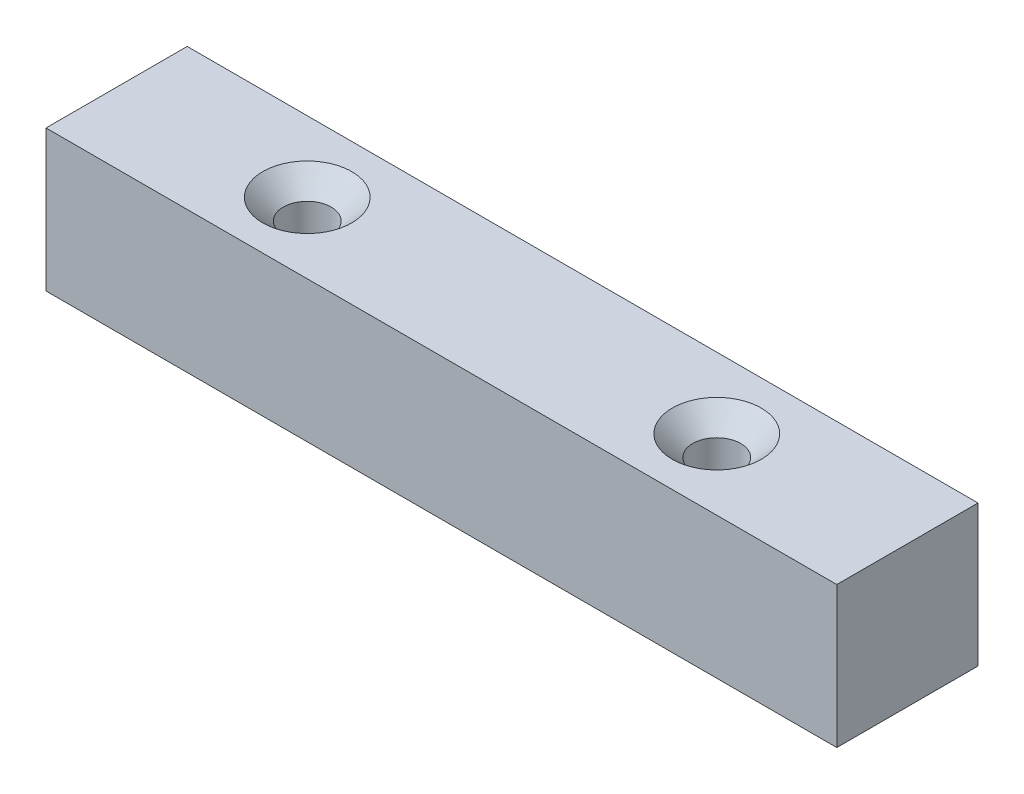
ISO-10303-21;
HEADER;
FILE_DESCRIPTION(('STEP AP214'),'2;1');
FILE_NAME('part.step','',(''),(''),'','','');
FILE_SCHEMA(('AUTOMOTIVE_DESIGN { 1 0 10303 214 1 1 1 1 }'));
ENDSEC;
DATA;
#1=APPLICATION_CONTEXT('core data for automotive mechanical design processes');
#2=APPLICATION_PROTOCOL_DEFINITION('international standard','automotive_design',2000,#1);
#3=PRODUCT_CONTEXT('',#1,'mechanical');
#4=PRODUCT('Part','Part','',(#3));
#5=PRODUCT_RELATED_PRODUCT_CATEGORY('part','',(#4));
#6=PRODUCT_DEFINITION_FORMATION('','',#4);
#7=PRODUCT_DEFINITION_CONTEXT('part definition',#1,'design');
#8=PRODUCT_DEFINITION('design','',#6,#7);
#9=PRODUCT_DEFINITION_SHAPE('','',#8);
#10=(LENGTH_UNIT() NAMED_UNIT(*) SI_UNIT(.MILLI.,.METRE.));
#11=(NAMED_UNIT(*) PLANE_ANGLE_UNIT() SI_UNIT($,.RADIAN.));
#12=(NAMED_UNIT(*) SI_UNIT($,.STERADIAN.) SOLID_ANGLE_UNIT());
#13=UNCERTAINTY_MEASURE_WITH_UNIT(LENGTH_MEASURE(1.E-05),#10,'distance_accuracy_value','');
#14=(GEOMETRIC_REPRESENTATION_CONTEXT(3) GLOBAL_UNCERTAINTY_ASSIGNED_CONTEXT((#13)) GLOBAL_UNIT_ASSIGNED_CONTEXT((#10,
#11,#12)) REPRESENTATION_CONTEXT('',''));
#15=CARTESIAN_POINT('',(0.,0.,0.));
#16=DIRECTION('',(0.,0.,1.));
#17=DIRECTION('',(1.,0.,0.));
#18=AXIS2_PLACEMENT_3D('',#15,#16,#17);
#19=CARTESIAN_POINT('',(-27.4573170731707,10.,-16.422256097561));
#20=DIRECTION('',(1.,0.,0.));
#21=DIRECTION('',(0.,0.,-1.));
#22=AXIS2_PLACEMENT_3D('',#19,#20,#21);
#23=PLANE('',#22);
#24=DIRECTION('',(0.,0.,1.));
#25=VECTOR('',#24,1.);
#26=CARTESIAN_POINT('',(-27.4573170731707,0.,-16.422256097561));
#27=LINE('',#26,#25);
#28=CARTESIAN_POINT('',(-27.4573170731707,0.,-16.422256097561));
#29=VERTEX_POINT('',#28);
#30=CARTESIAN_POINT('',(-27.4573170731707,0.,-6.42225609756098));
#31=VERTEX_POINT('',#30);
#32=EDGE_CURVE('E143',#29,#31,#27,.T.);
#33=ORIENTED_EDGE('',*,*,#32,.T.);
#34=DIRECTION('',(0.,-1.,0.));
#35=VECTOR('',#34,1.);
#36=CARTESIAN_POINT('',(-27.4573170731707,10.,-6.42225609756098));
#37=LINE('',#36,#35);
#38=CARTESIAN_POINT('',(-27.4573170731707,10.,-6.42225609756098));
#39=VERTEX_POINT('',#38);
#40=EDGE_CURVE('E11',#39,#31,#37,.T.);
#41=ORIENTED_EDGE('',*,*,#40,.F.);
#42=DIRECTION('',(0.,0.,1.));
#43=VECTOR('',#42,1.);
#44=CARTESIAN_POINT('',(-27.4573170731707,10.,-16.422256097561));
#45=LINE('',#44,#43);
#46=CARTESIAN_POINT('',(-27.4573170731707,10.,-16.422256097561));
#47=VERTEX_POINT('',#46);
#48=EDGE_CURVE('E144',#47,#39,#45,.T.);
#49=ORIENTED_EDGE('',*,*,#48,.F.);
#50=DIRECTION('',(0.,-1.,0.));
#51=VECTOR('',#50,1.);
#52=CARTESIAN_POINT('',(-27.4573170731707,10.,-16.422256097561));
#53=LINE('',#52,#51);
#54=EDGE_CURVE('E154',#47,#29,#53,.T.);
#55=ORIENTED_EDGE('',*,*,#54,.T.);
#56=EDGE_LOOP('',(#33,#41,#49,#55));
#57=FACE_BOUND('',#56,.T.);
#58=ADVANCED_FACE('F39',(#57),#23,.F.);
#59=CARTESIAN_POINT('',(-27.4573170731707,10.,-6.42225609756098));
#60=DIRECTION('',(0.,0.,-1.));
#61=DIRECTION('',(-1.,0.,0.));
#62=AXIS2_PLACEMENT_3D('',#59,#60,#61);
#63=PLANE('',#62);
#64=DIRECTION('',(1.,0.,0.));
#65=VECTOR('',#64,1.);
#66=CARTESIAN_POINT('',(-27.4573170731707,0.,-6.42225609756098));
#67=LINE('',#66,#65);
#68=CARTESIAN_POINT('',(28.5426829268293,0.,-6.42225609756098));
#69=VERTEX_POINT('',#68);
#70=EDGE_CURVE('E158',#31,#69,#67,.T.);
#71=ORIENTED_EDGE('',*,*,#70,.T.);
#72=DIRECTION('',(0.,-1.,0.));
#73=VECTOR('',#72,1.);
#74=CARTESIAN_POINT('',(28.5426829268293,10.,-6.42225609756098));
#75=LINE('',#74,#73);
#76=CARTESIAN_POINT('',(28.5426829268293,10.,-6.42225609756098));
#77=VERTEX_POINT('',#76);
#78=EDGE_CURVE('E48',#77,#69,#75,.T.);
#79=ORIENTED_EDGE('',*,*,#78,.F.);
#80=DIRECTION('',(1.,0.,0.));
#81=VECTOR('',#80,1.);
#82=CARTESIAN_POINT('',(-27.4573170731707,10.,-6.42225609756098));
#83=LINE('',#82,#81);
#84=EDGE_CURVE('E87',#39,#77,#83,.T.);
#85=ORIENTED_EDGE('',*,*,#84,.F.);
#86=ORIENTED_EDGE('',*,*,#40,.T.);
#87=EDGE_LOOP('',(#71,#79,#85,#86));
#88=FACE_BOUND('',#87,.T.);
#89=ADVANCED_FACE('F188',(#88),#63,.F.);
#90=CARTESIAN_POINT('',(28.5426829268293,10.,-16.422256097561));
#91=DIRECTION('',(-1.,0.,0.));
#92=DIRECTION('',(0.,0.,1.));
#93=AXIS2_PLACEMENT_3D('',#90,#91,#92);
#94=PLANE('',#93);
#95=DIRECTION('',(0.,0.,-1.));
#96=VECTOR('',#95,1.);
#97=CARTESIAN_POINT('',(28.5426829268293,0.,-16.422256097561));
#98=LINE('',#97,#96);
#99=CARTESIAN_POINT('',(28.5426829268293,0.,-16.422256097561));
#100=VERTEX_POINT('',#99);
#101=EDGE_CURVE('E74',#69,#100,#98,.T.);
#102=ORIENTED_EDGE('',*,*,#101,.T.);
#103=DIRECTION('',(0.,-1.,0.));
#104=VECTOR('',#103,1.);
#105=CARTESIAN_POINT('',(28.5426829268293,10.,-16.422256097561));
#106=LINE('',#105,#104);
#107=CARTESIAN_POINT('',(28.5426829268293,10.,-16.422256097561));
#108=VERTEX_POINT('',#107);
#109=EDGE_CURVE('E167',#108,#100,#106,.T.);
#110=ORIENTED_EDGE('',*,*,#109,.F.);
#111=DIRECTION('',(0.,0.,-1.));
#112=VECTOR('',#111,1.);
#113=CARTESIAN_POINT('',(28.5426829268293,10.,-16.422256097561));
#114=LINE('',#113,#112);
#115=EDGE_CURVE('E149',#77,#108,#114,.T.);
#116=ORIENTED_EDGE('',*,*,#115,.F.);
#117=ORIENTED_EDGE('',*,*,#78,.T.);
#118=EDGE_LOOP('',(#102,#110,#116,#117));
#119=FACE_BOUND('',#118,.T.);
#120=ADVANCED_FACE('F171',(#119),#94,.F.);
#121=CARTESIAN_POINT('',(-27.4573170731707,10.,-16.422256097561));
#122=DIRECTION('',(0.,0.,1.));
#123=DIRECTION('',(1.,0.,0.));
#124=AXIS2_PLACEMENT_3D('',#121,#122,#123);
#125=PLANE('',#124);
#126=DIRECTION('',(-1.,0.,0.));
#127=VECTOR('',#126,1.);
#128=CARTESIAN_POINT('',(-27.4573170731707,0.,-16.422256097561));
#129=LINE('',#128,#127);
#130=EDGE_CURVE('E80',#100,#29,#129,.T.);
#131=ORIENTED_EDGE('',*,*,#130,.T.);
#132=ORIENTED_EDGE('',*,*,#54,.F.);
#133=DIRECTION('',(-1.,0.,0.));
#134=VECTOR('',#133,1.);
#135=CARTESIAN_POINT('',(-27.4573170731707,10.,-16.422256097561));
#136=LINE('',#135,#134);
#137=EDGE_CURVE('E56',#108,#47,#136,.T.);
#138=ORIENTED_EDGE('',*,*,#137,.F.);
#139=ORIENTED_EDGE('',*,*,#109,.T.);
#140=EDGE_LOOP('',(#131,#132,#138,#139));
#141=FACE_BOUND('',#140,.T.);
#142=ADVANCED_FACE('F178',(#141),#125,.F.);
#143=CARTESIAN_POINT('',(0.,10.,0.));
#144=DIRECTION('',(0.,1.,0.));
#145=DIRECTION('',(0.,0.,1.));
#146=AXIS2_PLACEMENT_3D('',#143,#144,#145);
#147=PLANE('',#146);
#148=CARTESIAN_POINT('',(15.0426829268293,10.,-11.422256097561));
#149=DIRECTION('',(0.,1.,0.));
#150=DIRECTION('',(0.,0.,1.));
#151=AXIS2_PLACEMENT_3D('',#148,#149,#150);
#152=CIRCLE('',#151,3.15);
#153=CARTESIAN_POINT('',(15.0426829268293,10.,-8.27225609756098));
#154=VERTEX_POINT('',#153);
#155=EDGE_CURVE('E119',#154,#154,#152,.T.);
#156=ORIENTED_EDGE('',*,*,#155,.F.);
#157=EDGE_LOOP('',(#156));
#158=FACE_BOUND('',#157,.T.);
#159=CARTESIAN_POINT('',(-13.9573170731707,10.,-11.422256097561));
#160=DIRECTION('',(0.,1.,0.));
#161=DIRECTION('',(0.,0.,1.));
#162=AXIS2_PLACEMENT_3D('',#159,#160,#161);
#163=CIRCLE('',#162,3.15);
#164=CARTESIAN_POINT('',(-13.9573170731707,10.,-8.27225609756098));
#165=VERTEX_POINT('',#164);
#166=EDGE_CURVE('E131',#165,#165,#163,.T.);
#167=ORIENTED_EDGE('',*,*,#166,.F.);
#168=EDGE_LOOP('',(#167));
#169=FACE_BOUND('',#168,.T.);
#170=ORIENTED_EDGE('',*,*,#48,.T.);
#171=ORIENTED_EDGE('',*,*,#84,.T.);
#172=ORIENTED_EDGE('',*,*,#115,.T.);
#173=ORIENTED_EDGE('',*,*,#137,.T.);
#174=EDGE_LOOP('',(#170,#171,#172,#173));
#175=FACE_BOUND('',#174,.T.);
#176=ADVANCED_FACE('F180',(#158,#169,#175),#147,.T.);
#177=CARTESIAN_POINT('',(0.,0.,0.));
#178=DIRECTION('',(0.,1.,0.));
#179=DIRECTION('',(0.,0.,1.));
#180=AXIS2_PLACEMENT_3D('',#177,#178,#179);
#181=PLANE('',#180);
#182=CARTESIAN_POINT('',(-22.4573170731707,0.,-11.422256097561));
#183=DIRECTION('',(0.,-1.,0.));
#184=DIRECTION('',(0.,0.,-1.));
#185=AXIS2_PLACEMENT_3D('',#182,#183,#184);
#186=CIRCLE('',#185,2.49999999999999);
#187=CARTESIAN_POINT('',(-22.4573170731707,0.,-13.922256097561));
#188=VERTEX_POINT('',#187);
#189=EDGE_CURVE('E106',#188,#188,#186,.T.);
#190=ORIENTED_EDGE('',*,*,#189,.F.);
#191=EDGE_LOOP('',(#190));
#192=FACE_BOUND('',#191,.T.);
#193=CARTESIAN_POINT('',(23.5426829268293,0.,-11.422256097561));
#194=DIRECTION('',(0.,-1.,0.));
#195=DIRECTION('',(0.,0.,-1.));
#196=AXIS2_PLACEMENT_3D('',#193,#194,#195);
#197=CIRCLE('',#196,2.49999999999999);
#198=CARTESIAN_POINT('',(23.5426829268293,0.,-13.922256097561));
#199=VERTEX_POINT('',#198);
#200=EDGE_CURVE('E105',#199,#199,#197,.T.);
#201=ORIENTED_EDGE('',*,*,#200,.F.);
#202=EDGE_LOOP('',(#201));
#203=FACE_BOUND('',#202,.T.);
#204=CARTESIAN_POINT('',(15.0426829268293,0.,-11.422256097561));
#205=DIRECTION('',(0.,1.,0.));
#206=DIRECTION('',(0.,0.,1.));
#207=AXIS2_PLACEMENT_3D('',#204,#205,#206);
#208=CIRCLE('',#207,1.7);
#209=CARTESIAN_POINT('',(15.0426829268293,0.,-9.72225609756098));
#210=VERTEX_POINT('',#209);
#211=EDGE_CURVE('E127',#210,#210,#208,.T.);
#212=ORIENTED_EDGE('',*,*,#211,.T.);
#213=EDGE_LOOP('',(#212));
#214=FACE_BOUND('',#213,.T.);
#215=CARTESIAN_POINT('',(-13.9573170731707,0.,-11.422256097561));
#216=DIRECTION('',(0.,1.,0.));
#217=DIRECTION('',(0.,0.,1.));
#218=AXIS2_PLACEMENT_3D('',#215,#216,#217);
#219=CIRCLE('',#218,1.7);
#220=CARTESIAN_POINT('',(-13.9573170731707,0.,-9.72225609756098));
#221=VERTEX_POINT('',#220);
#222=EDGE_CURVE('E139',#221,#221,#219,.T.);
#223=ORIENTED_EDGE('',*,*,#222,.T.);
#224=EDGE_LOOP('',(#223));
#225=FACE_BOUND('',#224,.T.);
#226=ORIENTED_EDGE('',*,*,#32,.F.);
#227=ORIENTED_EDGE('',*,*,#130,.F.);
#228=ORIENTED_EDGE('',*,*,#101,.F.);
#229=ORIENTED_EDGE('',*,*,#70,.F.);
#230=EDGE_LOOP('',(#226,#227,#228,#229));
#231=FACE_BOUND('',#230,.T.);
#232=ADVANCED_FACE('F174',(#192,#203,#214,#225,#231),#181,.F.);
#233=CARTESIAN_POINT('',(-13.9573170731707,10.,-11.422256097561));
#234=DIRECTION('',(0.,1.,0.));
#235=DIRECTION('',(0.,0.,1.));
#236=AXIS2_PLACEMENT_3D('',#233,#234,#235);
#237=CYLINDRICAL_SURFACE('',#236,1.7);
#238=ORIENTED_EDGE('',*,*,#222,.F.);
#239=EDGE_LOOP('',(#238));
#240=FACE_BOUND('',#239,.T.);
#241=CARTESIAN_POINT('',(-13.9573170731707,8.55,-11.422256097561));
#242=DIRECTION('',(0.,1.,0.));
#243=DIRECTION('',(0.,0.,1.));
#244=AXIS2_PLACEMENT_3D('',#241,#242,#243);
#245=CIRCLE('',#244,1.7);
#246=CARTESIAN_POINT('',(-13.9573170731707,8.55,-9.72225609756098));
#247=VERTEX_POINT('',#246);
#248=EDGE_CURVE('E135',#247,#247,#245,.T.);
#249=ORIENTED_EDGE('',*,*,#248,.T.);
#250=EDGE_LOOP('',(#249));
#251=FACE_BOUND('',#250,.T.);
#252=ADVANCED_FACE('F218',(#240,#251),#237,.F.);
#253=CARTESIAN_POINT('',(-13.9573170731707,10.,-11.422256097561));
#254=DIRECTION('',(0.,1.,0.));
#255=DIRECTION('',(0.,0.,1.));
#256=AXIS2_PLACEMENT_3D('',#253,#254,#255);
#257=CONICAL_SURFACE('',#256,3.15,0.785398163397447);
#258=ORIENTED_EDGE('',*,*,#248,.F.);
#259=EDGE_LOOP('',(#258));
#260=FACE_BOUND('',#259,.T.);
#261=ORIENTED_EDGE('',*,*,#166,.T.);
#262=EDGE_LOOP('',(#261));
#263=FACE_BOUND('',#262,.T.);
#264=ADVANCED_FACE('F223',(#260,#263),#257,.F.);
#265=CARTESIAN_POINT('',(15.0426829268293,10.,-11.422256097561));
#266=DIRECTION('',(0.,1.,0.));
#267=DIRECTION('',(0.,0.,1.));
#268=AXIS2_PLACEMENT_3D('',#265,#266,#267);
#269=CYLINDRICAL_SURFACE('',#268,1.7);
#270=ORIENTED_EDGE('',*,*,#211,.F.);
#271=EDGE_LOOP('',(#270));
#272=FACE_BOUND('',#271,.T.);
#273=CARTESIAN_POINT('',(15.0426829268293,8.55,-11.422256097561));
#274=DIRECTION('',(0.,1.,0.));
#275=DIRECTION('',(0.,0.,1.));
#276=AXIS2_PLACEMENT_3D('',#273,#274,#275);
#277=CIRCLE('',#276,1.7);
#278=CARTESIAN_POINT('',(15.0426829268293,8.55,-9.72225609756098));
#279=VERTEX_POINT('',#278);
#280=EDGE_CURVE('E123',#279,#279,#277,.T.);
#281=ORIENTED_EDGE('',*,*,#280,.T.);
#282=EDGE_LOOP('',(#281));
#283=FACE_BOUND('',#282,.T.);
#284=ADVANCED_FACE('F233',(#272,#283),#269,.F.);
#285=CARTESIAN_POINT('',(15.0426829268293,10.,-11.422256097561));
#286=DIRECTION('',(0.,1.,0.));
#287=DIRECTION('',(0.,0.,1.));
#288=AXIS2_PLACEMENT_3D('',#285,#286,#287);
#289=CONICAL_SURFACE('',#288,3.15,0.785398163397448);
#290=ORIENTED_EDGE('',*,*,#280,.F.);
#291=EDGE_LOOP('',(#290));
#292=FACE_BOUND('',#291,.T.);
#293=ORIENTED_EDGE('',*,*,#155,.T.);
#294=EDGE_LOOP('',(#293));
#295=FACE_BOUND('',#294,.T.);
#296=ADVANCED_FACE('F243',(#292,#295),#289,.F.);
#297=CARTESIAN_POINT('',(23.5426829268293,5.,-11.422256097561));
#298=DIRECTION('',(0.,-1.,0.));
#299=DIRECTION('',(0.,0.,-1.));
#300=AXIS2_PLACEMENT_3D('',#297,#298,#299);
#301=CONICAL_SURFACE('',#300,2.5,1.02974425867665);
#302=CARTESIAN_POINT('',(23.5426829268293,6.5021515475689,-11.422256097561));
#303=VERTEX_POINT('',#302);
#304=VERTEX_LOOP('',#303);
#305=FACE_BOUND('',#304,.T.);
#306=CARTESIAN_POINT('',(23.5426829268293,5.,-11.422256097561));
#307=DIRECTION('',(0.,-1.,0.));
#308=DIRECTION('',(0.,0.,-1.));
#309=AXIS2_PLACEMENT_3D('',#306,#307,#308);
#310=CIRCLE('',#309,2.5);
#311=CARTESIAN_POINT('',(23.5426829268293,5.,-13.922256097561));
#312=VERTEX_POINT('',#311);
#313=EDGE_CURVE('E111',#312,#312,#310,.T.);
#314=ORIENTED_EDGE('',*,*,#313,.T.);
#315=EDGE_LOOP('',(#314));
#316=FACE_BOUND('',#315,.T.);
#317=ADVANCED_FACE('F253',(#305,#316),#301,.F.);
#318=CARTESIAN_POINT('',(23.5426829268293,0.,-11.422256097561));
#319=DIRECTION('',(0.,-1.,0.));
#320=DIRECTION('',(0.,0.,-1.));
#321=AXIS2_PLACEMENT_3D('',#318,#319,#320);
#322=CYLINDRICAL_SURFACE('',#321,2.49999999999999);
#323=ORIENTED_EDGE('',*,*,#313,.F.);
#324=EDGE_LOOP('',(#323));
#325=FACE_BOUND('',#324,.T.);
#326=ORIENTED_EDGE('',*,*,#200,.T.);
#327=EDGE_LOOP('',(#326));
#328=FACE_BOUND('',#327,.T.);
#329=ADVANCED_FACE('F98',(#325,#328),#322,.F.);
#330=CARTESIAN_POINT('',(-22.4573170731707,5.,-11.422256097561));
#331=DIRECTION('',(0.,-1.,0.));
#332=DIRECTION('',(0.,0.,-1.));
#333=AXIS2_PLACEMENT_3D('',#330,#331,#332);
#334=CONICAL_SURFACE('',#333,2.5,1.02974425867665);
#335=CARTESIAN_POINT('',(-22.4573170731707,6.5021515475689,-11.422256097561));
#336=VERTEX_POINT('',#335);
#337=VERTEX_LOOP('',#336);
#338=FACE_BOUND('',#337,.T.);
#339=CARTESIAN_POINT('',(-22.4573170731707,5.,-11.422256097561));
#340=DIRECTION('',(0.,-1.,0.));
#341=DIRECTION('',(0.,0.,-1.));
#342=AXIS2_PLACEMENT_3D('',#339,#340,#341);
#343=CIRCLE('',#342,2.5);
#344=CARTESIAN_POINT('',(-22.4573170731707,5.,-13.922256097561));
#345=VERTEX_POINT('',#344);
#346=EDGE_CURVE('E102',#345,#345,#343,.T.);
#347=ORIENTED_EDGE('',*,*,#346,.T.);
#348=EDGE_LOOP('',(#347));
#349=FACE_BOUND('',#348,.T.);
#350=ADVANCED_FACE('F94',(#338,#349),#334,.F.);
#351=CARTESIAN_POINT('',(-22.4573170731707,0.,-11.422256097561));
#352=DIRECTION('',(0.,-1.,0.));
#353=DIRECTION('',(0.,0.,-1.));
#354=AXIS2_PLACEMENT_3D('',#351,#352,#353);
#355=CYLINDRICAL_SURFACE('',#354,2.49999999999999);
#356=ORIENTED_EDGE('',*,*,#346,.F.);
#357=EDGE_LOOP('',(#356));
#358=FACE_BOUND('',#357,.T.);
#359=ORIENTED_EDGE('',*,*,#189,.T.);
#360=EDGE_LOOP('',(#359));
#361=FACE_BOUND('',#360,.T.);
#362=ADVANCED_FACE('F97',(#358,#361),#355,.F.);
#363=CLOSED_SHELL('',(#58,#89,#120,#142,#176,#232,#252,#264,#284,#296,#317,#329,#350,#362));
#364=MANIFOLD_SOLID_BREP('B2',#363);
#365=ADVANCED_BREP_SHAPE_REPRESENTATION('',(#18,#364),#14);
#366=SHAPE_DEFINITION_REPRESENTATION(#9,#365);
ENDSEC;
END-ISO-10303-21;
